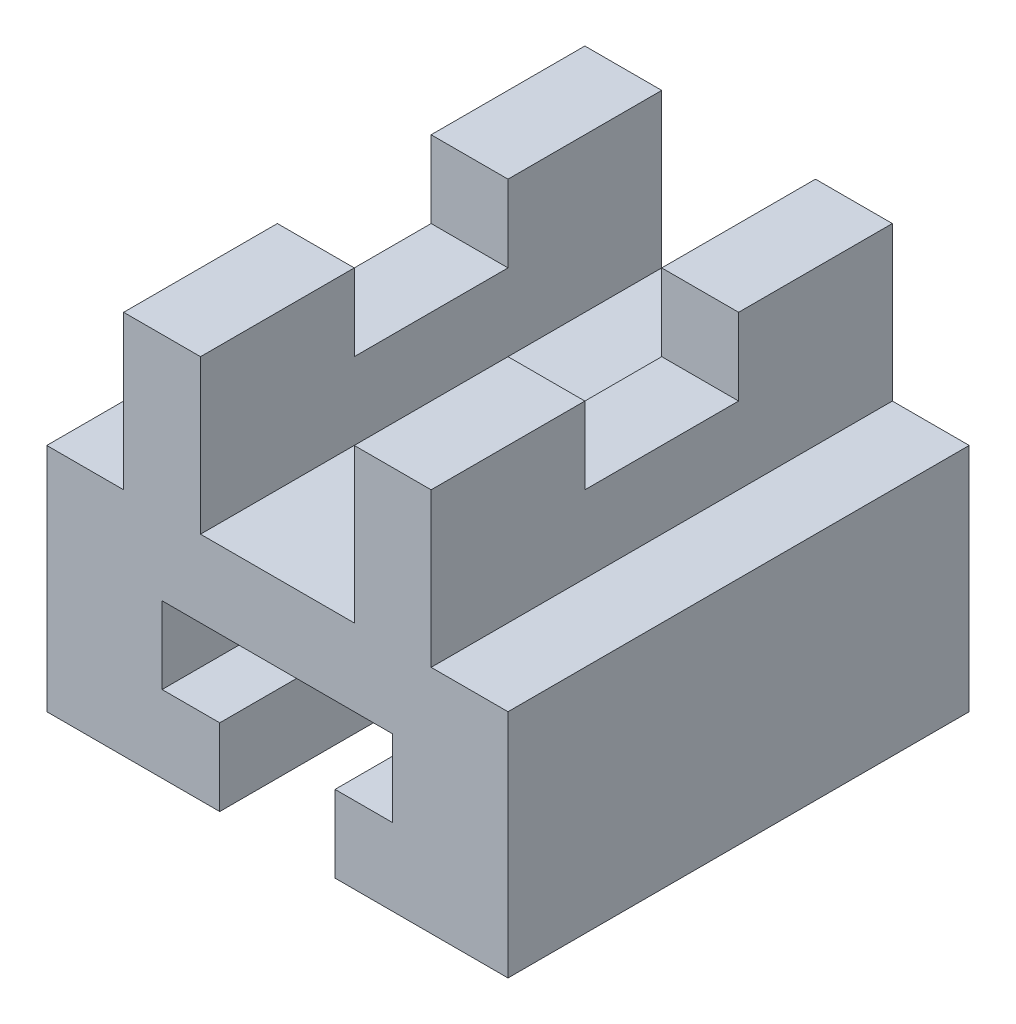
ISO-10303-21;
HEADER;
FILE_DESCRIPTION(('STEP AP214'),'2;1');
FILE_NAME('part.step','',(''),(''),'','','');
FILE_SCHEMA(('AUTOMOTIVE_DESIGN { 1 0 10303 214 1 1 1 1 }'));
ENDSEC;
DATA;
#1=APPLICATION_CONTEXT('core data for automotive mechanical design processes');
#2=APPLICATION_PROTOCOL_DEFINITION('international standard','automotive_design',2000,#1);
#3=PRODUCT_CONTEXT('',#1,'mechanical');
#4=PRODUCT('Part','Part','',(#3));
#5=PRODUCT_RELATED_PRODUCT_CATEGORY('part','',(#4));
#6=PRODUCT_DEFINITION_FORMATION('','',#4);
#7=PRODUCT_DEFINITION_CONTEXT('part definition',#1,'design');
#8=PRODUCT_DEFINITION('design','',#6,#7);
#9=PRODUCT_DEFINITION_SHAPE('','',#8);
#10=(LENGTH_UNIT() NAMED_UNIT(*) SI_UNIT(.MILLI.,.METRE.));
#11=(NAMED_UNIT(*) PLANE_ANGLE_UNIT() SI_UNIT($,.RADIAN.));
#12=(NAMED_UNIT(*) SI_UNIT($,.STERADIAN.) SOLID_ANGLE_UNIT());
#13=UNCERTAINTY_MEASURE_WITH_UNIT(LENGTH_MEASURE(1.E-05),#10,'distance_accuracy_value','');
#14=(GEOMETRIC_REPRESENTATION_CONTEXT(3) GLOBAL_UNCERTAINTY_ASSIGNED_CONTEXT((#13)) GLOBAL_UNIT_ASSIGNED_CONTEXT((#10,
#11,#12)) REPRESENTATION_CONTEXT('',''));
#15=CARTESIAN_POINT('',(0.,0.,0.));
#16=DIRECTION('',(0.,0.,1.));
#17=DIRECTION('',(1.,0.,0.));
#18=AXIS2_PLACEMENT_3D('',#15,#16,#17);
#19=CARTESIAN_POINT('',(14.6539451077223,30.,60.));
#20=DIRECTION('',(0.,-1.,0.));
#21=DIRECTION('',(1.,0.,0.));
#22=AXIS2_PLACEMENT_3D('',#19,#20,#21);
#23=PLANE('',#22);
#24=DIRECTION('',(0.,0.,-1.));
#25=VECTOR('',#24,1.);
#26=CARTESIAN_POINT('',(4.65394510772229,30.,60.));
#27=LINE('',#26,#25);
#28=CARTESIAN_POINT('',(4.6539451077223,30.,20.));
#29=VERTEX_POINT('',#28);
#30=CARTESIAN_POINT('',(4.65394510772229,30.,0.));
#31=VERTEX_POINT('',#30);
#32=EDGE_CURVE('E243',#29,#31,#27,.T.);
#33=ORIENTED_EDGE('',*,*,#32,.F.);
#34=DIRECTION('',(1.,0.,0.));
#35=VECTOR('',#34,1.);
#36=CARTESIAN_POINT('',(-35.3460548922778,30.,20.));
#37=LINE('',#36,#35);
#38=CARTESIAN_POINT('',(14.6539451077223,30.,20.));
#39=VERTEX_POINT('',#38);
#40=EDGE_CURVE('E227',#29,#39,#37,.T.);
#41=ORIENTED_EDGE('',*,*,#40,.T.);
#42=DIRECTION('',(0.,0.,-1.));
#43=VECTOR('',#42,1.);
#44=CARTESIAN_POINT('',(14.6539451077223,30.,60.));
#45=LINE('',#44,#43);
#46=CARTESIAN_POINT('',(14.6539451077223,30.,0.));
#47=VERTEX_POINT('',#46);
#48=EDGE_CURVE('E241',#39,#47,#45,.T.);
#49=ORIENTED_EDGE('',*,*,#48,.T.);
#50=DIRECTION('',(-1.,0.,0.));
#51=VECTOR('',#50,1.);
#52=CARTESIAN_POINT('',(14.6539451077223,30.,0.));
#53=LINE('',#52,#51);
#54=EDGE_CURVE('E435',#47,#31,#53,.T.);
#55=ORIENTED_EDGE('',*,*,#54,.T.);
#56=EDGE_LOOP('',(#33,#41,#49,#55));
#57=FACE_BOUND('',#56,.T.);
#58=ADVANCED_FACE('F39',(#57),#23,.F.);
#59=CARTESIAN_POINT('',(-15.3460548922777,30.,60.));
#60=DIRECTION('',(0.,-1.,0.));
#61=DIRECTION('',(0.,0.,-1.));
#62=AXIS2_PLACEMENT_3D('',#59,#60,#61);
#63=PLANE('',#62);
#64=DIRECTION('',(0.,0.,-1.));
#65=VECTOR('',#64,1.);
#66=CARTESIAN_POINT('',(-25.3460548922777,30.,60.));
#67=LINE('',#66,#65);
#68=CARTESIAN_POINT('',(-25.3460548922777,30.,20.));
#69=VERTEX_POINT('',#68);
#70=CARTESIAN_POINT('',(-25.3460548922777,30.,0.));
#71=VERTEX_POINT('',#70);
#72=EDGE_CURVE('E492',#69,#71,#67,.T.);
#73=ORIENTED_EDGE('',*,*,#72,.F.);
#74=CARTESIAN_POINT('',(-15.3460548922777,30.,20.));
#75=VERTEX_POINT('',#74);
#76=EDGE_CURVE('E245',#69,#75,#37,.T.);
#77=ORIENTED_EDGE('',*,*,#76,.T.);
#78=DIRECTION('',(0.,0.,-1.));
#79=VECTOR('',#78,1.);
#80=CARTESIAN_POINT('',(-15.3460548922777,30.,60.));
#81=LINE('',#80,#79);
#82=CARTESIAN_POINT('',(-15.3460548922777,30.,0.));
#83=VERTEX_POINT('',#82);
#84=EDGE_CURVE('E496',#75,#83,#81,.T.);
#85=ORIENTED_EDGE('',*,*,#84,.T.);
#86=DIRECTION('',(-1.,0.,0.));
#87=VECTOR('',#86,1.);
#88=CARTESIAN_POINT('',(-15.3460548922777,30.,0.));
#89=LINE('',#88,#87);
#90=EDGE_CURVE('E448',#83,#71,#89,.T.);
#91=ORIENTED_EDGE('',*,*,#90,.T.);
#92=EDGE_LOOP('',(#73,#77,#85,#91));
#93=FACE_BOUND('',#92,.T.);
#94=ADVANCED_FACE('F557',(#93),#63,.F.);
#95=CARTESIAN_POINT('',(-20.3460548922777,-10.,60.));
#96=DIRECTION('',(-1.,0.,0.));
#97=DIRECTION('',(0.,0.,1.));
#98=AXIS2_PLACEMENT_3D('',#95,#96,#97);
#99=PLANE('',#98);
#100=DIRECTION('',(0.,1.,0.));
#101=VECTOR('',#100,1.);
#102=CARTESIAN_POINT('',(-20.3460548922777,-10.,0.));
#103=LINE('',#102,#101);
#104=CARTESIAN_POINT('',(-20.3460548922777,-10.,0.));
#105=VERTEX_POINT('',#104);
#106=CARTESIAN_POINT('',(-20.3460548922777,0.,0.));
#107=VERTEX_POINT('',#106);
#108=EDGE_CURVE('E345',#105,#107,#103,.T.);
#109=ORIENTED_EDGE('',*,*,#108,.T.);
#110=DIRECTION('',(0.,0.,-1.));
#111=VECTOR('',#110,1.);
#112=CARTESIAN_POINT('',(-20.3460548922777,0.,60.));
#113=LINE('',#112,#111);
#114=CARTESIAN_POINT('',(-20.3460548922777,0.,60.));
#115=VERTEX_POINT('',#114);
#116=EDGE_CURVE('E291',#115,#107,#113,.T.);
#117=ORIENTED_EDGE('',*,*,#116,.F.);
#118=DIRECTION('',(0.,1.,0.));
#119=VECTOR('',#118,1.);
#120=CARTESIAN_POINT('',(-20.3460548922777,-10.,60.));
#121=LINE('',#120,#119);
#122=CARTESIAN_POINT('',(-20.3460548922777,-10.,60.));
#123=VERTEX_POINT('',#122);
#124=EDGE_CURVE('E346',#123,#115,#121,.T.);
#125=ORIENTED_EDGE('',*,*,#124,.F.);
#126=DIRECTION('',(0.,0.,-1.));
#127=VECTOR('',#126,1.);
#128=CARTESIAN_POINT('',(-20.3460548922777,-10.,60.));
#129=LINE('',#128,#127);
#130=EDGE_CURVE('E408',#123,#105,#129,.T.);
#131=ORIENTED_EDGE('',*,*,#130,.T.);
#132=EDGE_LOOP('',(#109,#117,#125,#131));
#133=FACE_BOUND('',#132,.T.);
#134=ADVANCED_FACE('F41',(#133),#99,.F.);
#135=CARTESIAN_POINT('',(-20.3460548922777,0.,60.));
#136=DIRECTION('',(0.,1.,0.));
#137=DIRECTION('',(0.,0.,1.));
#138=AXIS2_PLACEMENT_3D('',#135,#136,#137);
#139=PLANE('',#138);
#140=DIRECTION('',(1.,0.,0.));
#141=VECTOR('',#140,1.);
#142=CARTESIAN_POINT('',(-20.3460548922777,0.,0.));
#143=LINE('',#142,#141);
#144=CARTESIAN_POINT('',(9.65394510772229,0.,0.));
#145=VERTEX_POINT('',#144);
#146=EDGE_CURVE('E412',#107,#145,#143,.T.);
#147=ORIENTED_EDGE('',*,*,#146,.T.);
#148=DIRECTION('',(0.,0.,-1.));
#149=VECTOR('',#148,1.);
#150=CARTESIAN_POINT('',(9.65394510772229,0.,60.));
#151=LINE('',#150,#149);
#152=CARTESIAN_POINT('',(9.65394510772229,0.,60.));
#153=VERTEX_POINT('',#152);
#154=EDGE_CURVE('E287',#153,#145,#151,.T.);
#155=ORIENTED_EDGE('',*,*,#154,.F.);
#156=DIRECTION('',(1.,0.,0.));
#157=VECTOR('',#156,1.);
#158=CARTESIAN_POINT('',(-20.3460548922777,0.,60.));
#159=LINE('',#158,#157);
#160=EDGE_CURVE('E350',#115,#153,#159,.T.);
#161=ORIENTED_EDGE('',*,*,#160,.F.);
#162=ORIENTED_EDGE('',*,*,#116,.T.);
#163=EDGE_LOOP('',(#147,#155,#161,#162));
#164=FACE_BOUND('',#163,.T.);
#165=ADVANCED_FACE('F597',(#164),#139,.F.);
#166=CARTESIAN_POINT('',(9.65394510772229,0.,60.));
#167=DIRECTION('',(1.,0.,0.));
#168=DIRECTION('',(0.,1.,0.));
#169=AXIS2_PLACEMENT_3D('',#166,#167,#168);
#170=PLANE('',#169);
#171=DIRECTION('',(0.,-1.,0.));
#172=VECTOR('',#171,1.);
#173=CARTESIAN_POINT('',(9.65394510772229,0.,0.));
#174=LINE('',#173,#172);
#175=CARTESIAN_POINT('',(9.65394510772229,-9.99999999999999,0.));
#176=VERTEX_POINT('',#175);
#177=EDGE_CURVE('E415',#145,#176,#174,.T.);
#178=ORIENTED_EDGE('',*,*,#177,.T.);
#179=DIRECTION('',(0.,0.,-1.));
#180=VECTOR('',#179,1.);
#181=CARTESIAN_POINT('',(9.65394510772229,-9.99999999999999,60.));
#182=LINE('',#181,#180);
#183=CARTESIAN_POINT('',(9.65394510772229,-9.99999999999999,60.));
#184=VERTEX_POINT('',#183);
#185=EDGE_CURVE('E283',#184,#176,#182,.T.);
#186=ORIENTED_EDGE('',*,*,#185,.F.);
#187=DIRECTION('',(0.,-1.,0.));
#188=VECTOR('',#187,1.);
#189=CARTESIAN_POINT('',(9.65394510772229,0.,60.));
#190=LINE('',#189,#188);
#191=EDGE_CURVE('E354',#153,#184,#190,.T.);
#192=ORIENTED_EDGE('',*,*,#191,.F.);
#193=ORIENTED_EDGE('',*,*,#154,.T.);
#194=EDGE_LOOP('',(#178,#186,#192,#193));
#195=FACE_BOUND('',#194,.T.);
#196=ADVANCED_FACE('F594',(#195),#170,.F.);
#197=CARTESIAN_POINT('',(9.65394510772229,-9.99999999999999,60.));
#198=DIRECTION('',(0.,-1.,0.));
#199=DIRECTION('',(1.,0.,0.));
#200=AXIS2_PLACEMENT_3D('',#197,#198,#199);
#201=PLANE('',#200);
#202=DIRECTION('',(-1.,0.,0.));
#203=VECTOR('',#202,1.);
#204=CARTESIAN_POINT('',(9.65394510772229,-9.99999999999999,0.));
#205=LINE('',#204,#203);
#206=CARTESIAN_POINT('',(2.15394510772227,-10.,0.));
#207=VERTEX_POINT('',#206);
#208=EDGE_CURVE('E418',#176,#207,#205,.T.);
#209=ORIENTED_EDGE('',*,*,#208,.T.);
#210=DIRECTION('',(0.,0.,-1.));
#211=VECTOR('',#210,1.);
#212=CARTESIAN_POINT('',(2.15394510772227,-10.,60.));
#213=LINE('',#212,#211);
#214=CARTESIAN_POINT('',(2.15394510772227,-10.,60.));
#215=VERTEX_POINT('',#214);
#216=EDGE_CURVE('E279',#215,#207,#213,.T.);
#217=ORIENTED_EDGE('',*,*,#216,.F.);
#218=DIRECTION('',(-1.,0.,0.));
#219=VECTOR('',#218,1.);
#220=CARTESIAN_POINT('',(9.65394510772229,-9.99999999999999,60.));
#221=LINE('',#220,#219);
#222=EDGE_CURVE('E357',#184,#215,#221,.T.);
#223=ORIENTED_EDGE('',*,*,#222,.F.);
#224=ORIENTED_EDGE('',*,*,#185,.T.);
#225=EDGE_LOOP('',(#209,#217,#223,#224));
#226=FACE_BOUND('',#225,.T.);
#227=ADVANCED_FACE('F590',(#226),#201,.F.);
#228=CARTESIAN_POINT('',(2.15394510772227,-10.,60.));
#229=DIRECTION('',(1.,0.,0.));
#230=DIRECTION('',(0.,1.,0.));
#231=AXIS2_PLACEMENT_3D('',#228,#229,#230);
#232=PLANE('',#231);
#233=DIRECTION('',(0.,-1.,0.));
#234=VECTOR('',#233,1.);
#235=CARTESIAN_POINT('',(2.15394510772227,-10.,0.));
#236=LINE('',#235,#234);
#237=CARTESIAN_POINT('',(2.15394510772228,-20.,0.));
#238=VERTEX_POINT('',#237);
#239=EDGE_CURVE('E421',#207,#238,#236,.T.);
#240=ORIENTED_EDGE('',*,*,#239,.T.);
#241=DIRECTION('',(0.,0.,-1.));
#242=VECTOR('',#241,1.);
#243=CARTESIAN_POINT('',(2.15394510772228,-20.,60.));
#244=LINE('',#243,#242);
#245=CARTESIAN_POINT('',(2.15394510772228,-20.,60.));
#246=VERTEX_POINT('',#245);
#247=EDGE_CURVE('E275',#246,#238,#244,.T.);
#248=ORIENTED_EDGE('',*,*,#247,.F.);
#249=DIRECTION('',(0.,-1.,0.));
#250=VECTOR('',#249,1.);
#251=CARTESIAN_POINT('',(2.15394510772227,-10.,60.));
#252=LINE('',#251,#250);
#253=EDGE_CURVE('E360',#215,#246,#252,.T.);
#254=ORIENTED_EDGE('',*,*,#253,.F.);
#255=ORIENTED_EDGE('',*,*,#216,.T.);
#256=EDGE_LOOP('',(#240,#248,#254,#255));
#257=FACE_BOUND('',#256,.T.);
#258=ADVANCED_FACE('F586',(#257),#232,.F.);
#259=CARTESIAN_POINT('',(2.15394510772228,-20.,60.));
#260=DIRECTION('',(0.,1.,0.));
#261=DIRECTION('',(0.,0.,1.));
#262=AXIS2_PLACEMENT_3D('',#259,#260,#261);
#263=PLANE('',#262);
#264=DIRECTION('',(1.,0.,0.));
#265=VECTOR('',#264,1.);
#266=CARTESIAN_POINT('',(2.15394510772228,-20.,0.));
#267=LINE('',#266,#265);
#268=CARTESIAN_POINT('',(24.6539451077223,-20.,0.));
#269=VERTEX_POINT('',#268);
#270=EDGE_CURVE('E424',#238,#269,#267,.T.);
#271=ORIENTED_EDGE('',*,*,#270,.T.);
#272=DIRECTION('',(0.,0.,-1.));
#273=VECTOR('',#272,1.);
#274=CARTESIAN_POINT('',(24.6539451077223,-20.,60.));
#275=LINE('',#274,#273);
#276=CARTESIAN_POINT('',(24.6539451077223,-20.,60.));
#277=VERTEX_POINT('',#276);
#278=EDGE_CURVE('E271',#277,#269,#275,.T.);
#279=ORIENTED_EDGE('',*,*,#278,.F.);
#280=DIRECTION('',(1.,0.,0.));
#281=VECTOR('',#280,1.);
#282=CARTESIAN_POINT('',(2.15394510772228,-20.,60.));
#283=LINE('',#282,#281);
#284=EDGE_CURVE('E363',#246,#277,#283,.T.);
#285=ORIENTED_EDGE('',*,*,#284,.F.);
#286=ORIENTED_EDGE('',*,*,#247,.T.);
#287=EDGE_LOOP('',(#271,#279,#285,#286));
#288=FACE_BOUND('',#287,.T.);
#289=ADVANCED_FACE('F582',(#288),#263,.F.);
#290=CARTESIAN_POINT('',(24.6539451077223,-20.,60.));
#291=DIRECTION('',(-1.,0.,0.));
#292=DIRECTION('',(0.,-1.,0.));
#293=AXIS2_PLACEMENT_3D('',#290,#291,#292);
#294=PLANE('',#293);
#295=DIRECTION('',(0.,1.,0.));
#296=VECTOR('',#295,1.);
#297=CARTESIAN_POINT('',(24.6539451077223,-20.,0.));
#298=LINE('',#297,#296);
#299=CARTESIAN_POINT('',(24.6539451077223,10.,0.));
#300=VERTEX_POINT('',#299);
#301=EDGE_CURVE('E427',#269,#300,#298,.T.);
#302=ORIENTED_EDGE('',*,*,#301,.T.);
#303=DIRECTION('',(0.,0.,-1.));
#304=VECTOR('',#303,1.);
#305=CARTESIAN_POINT('',(24.6539451077223,10.,60.));
#306=LINE('',#305,#304);
#307=CARTESIAN_POINT('',(24.6539451077223,10.,60.));
#308=VERTEX_POINT('',#307);
#309=EDGE_CURVE('E267',#308,#300,#306,.T.);
#310=ORIENTED_EDGE('',*,*,#309,.F.);
#311=DIRECTION('',(0.,1.,0.));
#312=VECTOR('',#311,1.);
#313=CARTESIAN_POINT('',(24.6539451077223,-20.,60.));
#314=LINE('',#313,#312);
#315=EDGE_CURVE('E366',#277,#308,#314,.T.);
#316=ORIENTED_EDGE('',*,*,#315,.F.);
#317=ORIENTED_EDGE('',*,*,#278,.T.);
#318=EDGE_LOOP('',(#302,#310,#316,#317));
#319=FACE_BOUND('',#318,.T.);
#320=ADVANCED_FACE('F576',(#319),#294,.F.);
#321=CARTESIAN_POINT('',(24.6539451077223,10.,60.));
#322=DIRECTION('',(0.,-1.,0.));
#323=DIRECTION('',(0.,0.,-1.));
#324=AXIS2_PLACEMENT_3D('',#321,#322,#323);
#325=PLANE('',#324);
#326=DIRECTION('',(-1.,0.,0.));
#327=VECTOR('',#326,1.);
#328=CARTESIAN_POINT('',(24.6539451077223,10.,0.));
#329=LINE('',#328,#327);
#330=CARTESIAN_POINT('',(14.6539451077223,10.,0.));
#331=VERTEX_POINT('',#330);
#332=EDGE_CURVE('E430',#300,#331,#329,.T.);
#333=ORIENTED_EDGE('',*,*,#332,.T.);
#334=DIRECTION('',(0.,0.,-1.));
#335=VECTOR('',#334,1.);
#336=CARTESIAN_POINT('',(14.6539451077223,10.,60.));
#337=LINE('',#336,#335);
#338=CARTESIAN_POINT('',(14.6539451077223,10.,60.));
#339=VERTEX_POINT('',#338);
#340=EDGE_CURVE('E260',#339,#331,#337,.T.);
#341=ORIENTED_EDGE('',*,*,#340,.F.);
#342=DIRECTION('',(-1.,0.,0.));
#343=VECTOR('',#342,1.);
#344=CARTESIAN_POINT('',(24.6539451077223,10.,60.));
#345=LINE('',#344,#343);
#346=EDGE_CURVE('E369',#308,#339,#345,.T.);
#347=ORIENTED_EDGE('',*,*,#346,.F.);
#348=ORIENTED_EDGE('',*,*,#309,.T.);
#349=EDGE_LOOP('',(#333,#341,#347,#348));
#350=FACE_BOUND('',#349,.T.);
#351=ADVANCED_FACE('F572',(#350),#325,.F.);
#352=CARTESIAN_POINT('',(14.6539451077223,10.,60.));
#353=DIRECTION('',(-1.,0.,0.));
#354=DIRECTION('',(0.,0.,1.));
#355=AXIS2_PLACEMENT_3D('',#352,#353,#354);
#356=PLANE('',#355);
#357=ORIENTED_EDGE('',*,*,#48,.F.);
#358=DIRECTION('',(0.,1.,0.));
#359=VECTOR('',#358,1.);
#360=CARTESIAN_POINT('',(14.6539451077223,20.,20.));
#361=LINE('',#360,#359);
#362=CARTESIAN_POINT('',(14.6539451077223,20.,20.));
#363=VERTEX_POINT('',#362);
#364=EDGE_CURVE('E224',#363,#39,#361,.T.);
#365=ORIENTED_EDGE('',*,*,#364,.F.);
#366=DIRECTION('',(0.,0.,-1.));
#367=VECTOR('',#366,1.);
#368=CARTESIAN_POINT('',(14.6539451077223,20.,40.));
#369=LINE('',#368,#367);
#370=CARTESIAN_POINT('',(14.6539451077223,20.,40.));
#371=VERTEX_POINT('',#370);
#372=EDGE_CURVE('E246',#371,#363,#369,.T.);
#373=ORIENTED_EDGE('',*,*,#372,.F.);
#374=DIRECTION('',(0.,-1.,0.));
#375=VECTOR('',#374,1.);
#376=CARTESIAN_POINT('',(14.6539451077223,30.,40.));
#377=LINE('',#376,#375);
#378=CARTESIAN_POINT('',(14.6539451077223,30.,40.));
#379=VERTEX_POINT('',#378);
#380=EDGE_CURVE('E236',#379,#371,#377,.T.);
#381=ORIENTED_EDGE('',*,*,#380,.F.);
#382=CARTESIAN_POINT('',(14.6539451077223,30.,60.));
#383=VERTEX_POINT('',#382);
#384=EDGE_CURVE('E254',#383,#379,#45,.T.);
#385=ORIENTED_EDGE('',*,*,#384,.F.);
#386=DIRECTION('',(0.,1.,0.));
#387=VECTOR('',#386,1.);
#388=CARTESIAN_POINT('',(14.6539451077223,10.,60.));
#389=LINE('',#388,#387);
#390=EDGE_CURVE('E372',#339,#383,#389,.T.);
#391=ORIENTED_EDGE('',*,*,#390,.F.);
#392=ORIENTED_EDGE('',*,*,#340,.T.);
#393=DIRECTION('',(0.,1.,0.));
#394=VECTOR('',#393,1.);
#395=CARTESIAN_POINT('',(14.6539451077223,10.,0.));
#396=LINE('',#395,#394);
#397=EDGE_CURVE('E251',#331,#47,#396,.T.);
#398=ORIENTED_EDGE('',*,*,#397,.T.);
#399=EDGE_LOOP('',(#357,#365,#373,#381,#385,#391,#392,#398));
#400=FACE_BOUND('',#399,.T.);
#401=ADVANCED_FACE('F248',(#400),#356,.F.);
#402=ORIENTED_EDGE('',*,*,#384,.T.);
#403=DIRECTION('',(1.,0.,0.));
#404=VECTOR('',#403,1.);
#405=CARTESIAN_POINT('',(-35.3460548922778,30.,40.));
#406=LINE('',#405,#404);
#407=CARTESIAN_POINT('',(4.6539451077223,30.,40.));
#408=VERTEX_POINT('',#407);
#409=EDGE_CURVE('E327',#408,#379,#406,.T.);
#410=ORIENTED_EDGE('',*,*,#409,.F.);
#411=CARTESIAN_POINT('',(4.65394510772229,30.,60.));
#412=VERTEX_POINT('',#411);
#413=EDGE_CURVE('E255',#412,#408,#27,.T.);
#414=ORIENTED_EDGE('',*,*,#413,.F.);
#415=DIRECTION('',(-1.,0.,0.));
#416=VECTOR('',#415,1.);
#417=CARTESIAN_POINT('',(14.6539451077223,30.,60.));
#418=LINE('',#417,#416);
#419=EDGE_CURVE('E375',#383,#412,#418,.T.);
#420=ORIENTED_EDGE('',*,*,#419,.F.);
#421=EDGE_LOOP('',(#402,#410,#414,#420));
#422=FACE_BOUND('',#421,.T.);
#423=ADVANCED_FACE('F536',(#422),#23,.F.);
#424=CARTESIAN_POINT('',(4.65394510772229,30.,60.));
#425=DIRECTION('',(1.,0.,0.));
#426=DIRECTION('',(0.,1.,0.));
#427=AXIS2_PLACEMENT_3D('',#424,#425,#426);
#428=PLANE('',#427);
#429=DIRECTION('',(0.,0.,-1.));
#430=VECTOR('',#429,1.);
#431=CARTESIAN_POINT('',(4.65394510772229,20.,60.));
#432=LINE('',#431,#430);
#433=CARTESIAN_POINT('',(4.65394510772229,20.,40.));
#434=VERTEX_POINT('',#433);
#435=CARTESIAN_POINT('',(4.6539451077223,20.,20.));
#436=VERTEX_POINT('',#435);
#437=EDGE_CURVE('E335',#434,#436,#432,.T.);
#438=ORIENTED_EDGE('',*,*,#437,.T.);
#439=DIRECTION('',(0.,1.,0.));
#440=VECTOR('',#439,1.);
#441=CARTESIAN_POINT('',(4.65394510772229,30.,20.));
#442=LINE('',#441,#440);
#443=EDGE_CURVE('E342',#436,#29,#442,.T.);
#444=ORIENTED_EDGE('',*,*,#443,.T.);
#445=ORIENTED_EDGE('',*,*,#32,.T.);
#446=DIRECTION('',(0.,-1.,0.));
#447=VECTOR('',#446,1.);
#448=CARTESIAN_POINT('',(4.65394510772229,30.,0.));
#449=LINE('',#448,#447);
#450=CARTESIAN_POINT('',(4.65394510772229,10.,0.));
#451=VERTEX_POINT('',#450);
#452=EDGE_CURVE('E438',#31,#451,#449,.T.);
#453=ORIENTED_EDGE('',*,*,#452,.T.);
#454=DIRECTION('',(0.,0.,-1.));
#455=VECTOR('',#454,1.);
#456=CARTESIAN_POINT('',(4.65394510772229,10.,60.));
#457=LINE('',#456,#455);
#458=CARTESIAN_POINT('',(4.65394510772229,10.,60.));
#459=VERTEX_POINT('',#458);
#460=EDGE_CURVE('E504',#459,#451,#457,.T.);
#461=ORIENTED_EDGE('',*,*,#460,.F.);
#462=DIRECTION('',(0.,-1.,0.));
#463=VECTOR('',#462,1.);
#464=CARTESIAN_POINT('',(4.65394510772229,30.,60.));
#465=LINE('',#464,#463);
#466=EDGE_CURVE('E378',#412,#459,#465,.T.);
#467=ORIENTED_EDGE('',*,*,#466,.F.);
#468=ORIENTED_EDGE('',*,*,#413,.T.);
#469=DIRECTION('',(0.,-1.,0.));
#470=VECTOR('',#469,1.);
#471=CARTESIAN_POINT('',(4.65394510772229,30.,40.));
#472=LINE('',#471,#470);
#473=EDGE_CURVE('E319',#408,#434,#472,.T.);
#474=ORIENTED_EDGE('',*,*,#473,.T.);
#475=EDGE_LOOP('',(#438,#444,#445,#453,#461,#467,#468,#474));
#476=FACE_BOUND('',#475,.T.);
#477=ADVANCED_FACE('F513',(#476),#428,.F.);
#478=CARTESIAN_POINT('',(4.65394510772229,10.,60.));
#479=DIRECTION('',(0.,-1.,0.));
#480=DIRECTION('',(1.,0.,0.));
#481=AXIS2_PLACEMENT_3D('',#478,#479,#480);
#482=PLANE('',#481);
#483=DIRECTION('',(-1.,0.,0.));
#484=VECTOR('',#483,1.);
#485=CARTESIAN_POINT('',(4.65394510772229,10.,0.));
#486=LINE('',#485,#484);
#487=CARTESIAN_POINT('',(-15.3460548922777,10.,0.));
#488=VERTEX_POINT('',#487);
#489=EDGE_CURVE('E441',#451,#488,#486,.T.);
#490=ORIENTED_EDGE('',*,*,#489,.T.);
#491=DIRECTION('',(0.,0.,-1.));
#492=VECTOR('',#491,1.);
#493=CARTESIAN_POINT('',(-15.3460548922777,10.,60.));
#494=LINE('',#493,#492);
#495=CARTESIAN_POINT('',(-15.3460548922777,10.,60.));
#496=VERTEX_POINT('',#495);
#497=EDGE_CURVE('E501',#496,#488,#494,.T.);
#498=ORIENTED_EDGE('',*,*,#497,.F.);
#499=DIRECTION('',(-1.,0.,0.));
#500=VECTOR('',#499,1.);
#501=CARTESIAN_POINT('',(4.65394510772229,10.,60.));
#502=LINE('',#501,#500);
#503=EDGE_CURVE('E381',#459,#496,#502,.T.);
#504=ORIENTED_EDGE('',*,*,#503,.F.);
#505=ORIENTED_EDGE('',*,*,#460,.T.);
#506=EDGE_LOOP('',(#490,#498,#504,#505));
#507=FACE_BOUND('',#506,.T.);
#508=ADVANCED_FACE('F521',(#507),#482,.F.);
#509=CARTESIAN_POINT('',(-15.3460548922777,10.,60.));
#510=DIRECTION('',(-1.,0.,0.));
#511=DIRECTION('',(0.,0.,1.));
#512=AXIS2_PLACEMENT_3D('',#509,#510,#511);
#513=PLANE('',#512);
#514=ORIENTED_EDGE('',*,*,#84,.F.);
#515=DIRECTION('',(0.,-1.,0.));
#516=VECTOR('',#515,1.);
#517=CARTESIAN_POINT('',(-15.3460548922777,10.,20.));
#518=LINE('',#517,#516);
#519=CARTESIAN_POINT('',(-15.3460548922777,20.,20.));
#520=VERTEX_POINT('',#519);
#521=EDGE_CURVE('E339',#75,#520,#518,.T.);
#522=ORIENTED_EDGE('',*,*,#521,.T.);
#523=DIRECTION('',(0.,0.,1.));
#524=VECTOR('',#523,1.);
#525=CARTESIAN_POINT('',(-15.3460548922777,20.,60.));
#526=LINE('',#525,#524);
#527=CARTESIAN_POINT('',(-15.3460548922777,20.,40.));
#528=VERTEX_POINT('',#527);
#529=EDGE_CURVE('E310',#520,#528,#526,.T.);
#530=ORIENTED_EDGE('',*,*,#529,.T.);
#531=DIRECTION('',(0.,1.,0.));
#532=VECTOR('',#531,1.);
#533=CARTESIAN_POINT('',(-15.3460548922777,10.,40.));
#534=LINE('',#533,#532);
#535=CARTESIAN_POINT('',(-15.3460548922777,30.,40.));
#536=VERTEX_POINT('',#535);
#537=EDGE_CURVE('E314',#528,#536,#534,.T.);
#538=ORIENTED_EDGE('',*,*,#537,.T.);
#539=CARTESIAN_POINT('',(-15.3460548922777,30.,60.));
#540=VERTEX_POINT('',#539);
#541=EDGE_CURVE('E497',#540,#536,#81,.T.);
#542=ORIENTED_EDGE('',*,*,#541,.F.);
#543=DIRECTION('',(0.,1.,0.));
#544=VECTOR('',#543,1.);
#545=CARTESIAN_POINT('',(-15.3460548922777,10.,60.));
#546=LINE('',#545,#544);
#547=EDGE_CURVE('E384',#496,#540,#546,.T.);
#548=ORIENTED_EDGE('',*,*,#547,.F.);
#549=ORIENTED_EDGE('',*,*,#497,.T.);
#550=DIRECTION('',(0.,1.,0.));
#551=VECTOR('',#550,1.);
#552=CARTESIAN_POINT('',(-15.3460548922777,10.,0.));
#553=LINE('',#552,#551);
#554=EDGE_CURVE('E444',#488,#83,#553,.T.);
#555=ORIENTED_EDGE('',*,*,#554,.T.);
#556=EDGE_LOOP('',(#514,#522,#530,#538,#542,#548,#549,#555));
#557=FACE_BOUND('',#556,.T.);
#558=ADVANCED_FACE('F525',(#557),#513,.F.);
#559=ORIENTED_EDGE('',*,*,#541,.T.);
#560=CARTESIAN_POINT('',(-25.3460548922777,30.,40.));
#561=VERTEX_POINT('',#560);
#562=EDGE_CURVE('E326',#561,#536,#406,.T.);
#563=ORIENTED_EDGE('',*,*,#562,.F.);
#564=CARTESIAN_POINT('',(-25.3460548922777,30.,60.));
#565=VERTEX_POINT('',#564);
#566=EDGE_CURVE('E493',#565,#561,#67,.T.);
#567=ORIENTED_EDGE('',*,*,#566,.F.);
#568=DIRECTION('',(-1.,0.,0.));
#569=VECTOR('',#568,1.);
#570=CARTESIAN_POINT('',(-15.3460548922777,30.,60.));
#571=LINE('',#570,#569);
#572=EDGE_CURVE('E387',#540,#565,#571,.T.);
#573=ORIENTED_EDGE('',*,*,#572,.F.);
#574=EDGE_LOOP('',(#559,#563,#567,#573));
#575=FACE_BOUND('',#574,.T.);
#576=ADVANCED_FACE('F564',(#575),#63,.F.);
#577=CARTESIAN_POINT('',(-25.3460548922777,30.,60.));
#578=DIRECTION('',(1.,0.,0.));
#579=DIRECTION('',(0.,0.,-1.));
#580=AXIS2_PLACEMENT_3D('',#577,#578,#579);
#581=PLANE('',#580);
#582=DIRECTION('',(0.,0.,-1.));
#583=VECTOR('',#582,1.);
#584=CARTESIAN_POINT('',(-25.3460548922777,20.,60.));
#585=LINE('',#584,#583);
#586=CARTESIAN_POINT('',(-25.3460548922777,20.,40.));
#587=VERTEX_POINT('',#586);
#588=CARTESIAN_POINT('',(-25.3460548922777,20.,20.));
#589=VERTEX_POINT('',#588);
#590=EDGE_CURVE('E48',#587,#589,#585,.T.);
#591=ORIENTED_EDGE('',*,*,#590,.T.);
#592=DIRECTION('',(0.,1.,0.));
#593=VECTOR('',#592,1.);
#594=CARTESIAN_POINT('',(-25.3460548922777,30.,20.));
#595=LINE('',#594,#593);
#596=EDGE_CURVE('E11',#589,#69,#595,.T.);
#597=ORIENTED_EDGE('',*,*,#596,.T.);
#598=ORIENTED_EDGE('',*,*,#72,.T.);
#599=DIRECTION('',(0.,-1.,0.));
#600=VECTOR('',#599,1.);
#601=CARTESIAN_POINT('',(-25.3460548922777,30.,0.));
#602=LINE('',#601,#600);
#603=CARTESIAN_POINT('',(-25.3460548922777,10.,0.));
#604=VERTEX_POINT('',#603);
#605=EDGE_CURVE('E452',#71,#604,#602,.T.);
#606=ORIENTED_EDGE('',*,*,#605,.T.);
#607=DIRECTION('',(0.,0.,-1.));
#608=VECTOR('',#607,1.);
#609=CARTESIAN_POINT('',(-25.3460548922777,10.,60.));
#610=LINE('',#609,#608);
#611=CARTESIAN_POINT('',(-25.3460548922777,10.,60.));
#612=VERTEX_POINT('',#611);
#613=EDGE_CURVE('E488',#612,#604,#610,.T.);
#614=ORIENTED_EDGE('',*,*,#613,.F.);
#615=DIRECTION('',(0.,-1.,0.));
#616=VECTOR('',#615,1.);
#617=CARTESIAN_POINT('',(-25.3460548922777,30.,60.));
#618=LINE('',#617,#616);
#619=EDGE_CURVE('E390',#565,#612,#618,.T.);
#620=ORIENTED_EDGE('',*,*,#619,.F.);
#621=ORIENTED_EDGE('',*,*,#566,.T.);
#622=DIRECTION('',(0.,-1.,0.));
#623=VECTOR('',#622,1.);
#624=CARTESIAN_POINT('',(-25.3460548922777,30.,40.));
#625=LINE('',#624,#623);
#626=EDGE_CURVE('E295',#561,#587,#625,.T.);
#627=ORIENTED_EDGE('',*,*,#626,.T.);
#628=EDGE_LOOP('',(#591,#597,#598,#606,#614,#620,#621,#627));
#629=FACE_BOUND('',#628,.T.);
#630=ADVANCED_FACE('F301',(#629),#581,.F.);
#631=CARTESIAN_POINT('',(-25.3460548922777,10.,60.));
#632=DIRECTION('',(0.,-1.,0.));
#633=DIRECTION('',(0.,0.,-1.));
#634=AXIS2_PLACEMENT_3D('',#631,#632,#633);
#635=PLANE('',#634);
#636=DIRECTION('',(-1.,0.,0.));
#637=VECTOR('',#636,1.);
#638=CARTESIAN_POINT('',(-25.3460548922777,10.,0.));
#639=LINE('',#638,#637);
#640=CARTESIAN_POINT('',(-35.3460548922778,10.,0.));
#641=VERTEX_POINT('',#640);
#642=EDGE_CURVE('E455',#604,#641,#639,.T.);
#643=ORIENTED_EDGE('',*,*,#642,.T.);
#644=DIRECTION('',(0.,0.,-1.));
#645=VECTOR('',#644,1.);
#646=CARTESIAN_POINT('',(-35.3460548922778,10.,60.));
#647=LINE('',#646,#645);
#648=CARTESIAN_POINT('',(-35.3460548922778,10.,60.));
#649=VERTEX_POINT('',#648);
#650=EDGE_CURVE('E484',#649,#641,#647,.T.);
#651=ORIENTED_EDGE('',*,*,#650,.F.);
#652=DIRECTION('',(-1.,0.,0.));
#653=VECTOR('',#652,1.);
#654=CARTESIAN_POINT('',(-25.3460548922777,10.,60.));
#655=LINE('',#654,#653);
#656=EDGE_CURVE('E393',#612,#649,#655,.T.);
#657=ORIENTED_EDGE('',*,*,#656,.F.);
#658=ORIENTED_EDGE('',*,*,#613,.T.);
#659=EDGE_LOOP('',(#643,#651,#657,#658));
#660=FACE_BOUND('',#659,.T.);
#661=ADVANCED_FACE('F645',(#660),#635,.F.);
#662=CARTESIAN_POINT('',(-35.3460548922778,10.,60.));
#663=DIRECTION('',(1.,0.,0.));
#664=DIRECTION('',(0.,0.,-1.));
#665=AXIS2_PLACEMENT_3D('',#662,#663,#664);
#666=PLANE('',#665);
#667=DIRECTION('',(0.,-1.,0.));
#668=VECTOR('',#667,1.);
#669=CARTESIAN_POINT('',(-35.3460548922778,10.,0.));
#670=LINE('',#669,#668);
#671=CARTESIAN_POINT('',(-35.3460548922778,-20.,0.));
#672=VERTEX_POINT('',#671);
#673=EDGE_CURVE('E458',#641,#672,#670,.T.);
#674=ORIENTED_EDGE('',*,*,#673,.T.);
#675=DIRECTION('',(0.,0.,-1.));
#676=VECTOR('',#675,1.);
#677=CARTESIAN_POINT('',(-35.3460548922778,-20.,60.));
#678=LINE('',#677,#676);
#679=CARTESIAN_POINT('',(-35.3460548922778,-20.,60.));
#680=VERTEX_POINT('',#679);
#681=EDGE_CURVE('E480',#680,#672,#678,.T.);
#682=ORIENTED_EDGE('',*,*,#681,.F.);
#683=DIRECTION('',(0.,-1.,0.));
#684=VECTOR('',#683,1.);
#685=CARTESIAN_POINT('',(-35.3460548922778,10.,60.));
#686=LINE('',#685,#684);
#687=EDGE_CURVE('E396',#649,#680,#686,.T.);
#688=ORIENTED_EDGE('',*,*,#687,.F.);
#689=ORIENTED_EDGE('',*,*,#650,.T.);
#690=EDGE_LOOP('',(#674,#682,#688,#689));
#691=FACE_BOUND('',#690,.T.);
#692=ADVANCED_FACE('F640',(#691),#666,.F.);
#693=CARTESIAN_POINT('',(-35.3460548922778,-20.,60.));
#694=DIRECTION('',(0.,1.,0.));
#695=DIRECTION('',(0.,0.,1.));
#696=AXIS2_PLACEMENT_3D('',#693,#694,#695);
#697=PLANE('',#696);
#698=DIRECTION('',(1.,0.,0.));
#699=VECTOR('',#698,1.);
#700=CARTESIAN_POINT('',(-35.3460548922778,-20.,0.));
#701=LINE('',#700,#699);
#702=CARTESIAN_POINT('',(-12.8460548922777,-20.,0.));
#703=VERTEX_POINT('',#702);
#704=EDGE_CURVE('E461',#672,#703,#701,.T.);
#705=ORIENTED_EDGE('',*,*,#704,.T.);
#706=DIRECTION('',(0.,0.,-1.));
#707=VECTOR('',#706,1.);
#708=CARTESIAN_POINT('',(-12.8460548922777,-20.,60.));
#709=LINE('',#708,#707);
#710=CARTESIAN_POINT('',(-12.8460548922777,-20.,60.));
#711=VERTEX_POINT('',#710);
#712=EDGE_CURVE('E476',#711,#703,#709,.T.);
#713=ORIENTED_EDGE('',*,*,#712,.F.);
#714=DIRECTION('',(1.,0.,0.));
#715=VECTOR('',#714,1.);
#716=CARTESIAN_POINT('',(-35.3460548922778,-20.,60.));
#717=LINE('',#716,#715);
#718=EDGE_CURVE('E399',#680,#711,#717,.T.);
#719=ORIENTED_EDGE('',*,*,#718,.F.);
#720=ORIENTED_EDGE('',*,*,#681,.T.);
#721=EDGE_LOOP('',(#705,#713,#719,#720));
#722=FACE_BOUND('',#721,.T.);
#723=ADVANCED_FACE('F634',(#722),#697,.F.);
#724=CARTESIAN_POINT('',(-12.8460548922777,-20.,60.));
#725=DIRECTION('',(-1.,0.,0.));
#726=DIRECTION('',(0.,-1.,0.));
#727=AXIS2_PLACEMENT_3D('',#724,#725,#726);
#728=PLANE('',#727);
#729=DIRECTION('',(0.,1.,0.));
#730=VECTOR('',#729,1.);
#731=CARTESIAN_POINT('',(-12.8460548922777,-20.,0.));
#732=LINE('',#731,#730);
#733=CARTESIAN_POINT('',(-12.8460548922777,-10.,0.));
#734=VERTEX_POINT('',#733);
#735=EDGE_CURVE('E464',#703,#734,#732,.T.);
#736=ORIENTED_EDGE('',*,*,#735,.T.);
#737=DIRECTION('',(0.,0.,-1.));
#738=VECTOR('',#737,1.);
#739=CARTESIAN_POINT('',(-12.8460548922777,-10.,60.));
#740=LINE('',#739,#738);
#741=CARTESIAN_POINT('',(-12.8460548922777,-10.,60.));
#742=VERTEX_POINT('',#741);
#743=EDGE_CURVE('E472',#742,#734,#740,.T.);
#744=ORIENTED_EDGE('',*,*,#743,.F.);
#745=DIRECTION('',(0.,1.,0.));
#746=VECTOR('',#745,1.);
#747=CARTESIAN_POINT('',(-12.8460548922777,-20.,60.));
#748=LINE('',#747,#746);
#749=EDGE_CURVE('E402',#711,#742,#748,.T.);
#750=ORIENTED_EDGE('',*,*,#749,.F.);
#751=ORIENTED_EDGE('',*,*,#712,.T.);
#752=EDGE_LOOP('',(#736,#744,#750,#751));
#753=FACE_BOUND('',#752,.T.);
#754=ADVANCED_FACE('F630',(#753),#728,.F.);
#755=CARTESIAN_POINT('',(-12.8460548922777,-10.,60.));
#756=DIRECTION('',(0.,-1.,0.));
#757=DIRECTION('',(1.,0.,0.));
#758=AXIS2_PLACEMENT_3D('',#755,#756,#757);
#759=PLANE('',#758);
#760=DIRECTION('',(-1.,0.,0.));
#761=VECTOR('',#760,1.);
#762=CARTESIAN_POINT('',(-12.8460548922777,-10.,0.));
#763=LINE('',#762,#761);
#764=EDGE_CURVE('E351',#734,#105,#763,.T.);
#765=ORIENTED_EDGE('',*,*,#764,.T.);
#766=ORIENTED_EDGE('',*,*,#130,.F.);
#767=DIRECTION('',(-1.,0.,0.));
#768=VECTOR('',#767,1.);
#769=CARTESIAN_POINT('',(-12.8460548922777,-10.,60.));
#770=LINE('',#769,#768);
#771=EDGE_CURVE('E405',#742,#123,#770,.T.);
#772=ORIENTED_EDGE('',*,*,#771,.F.);
#773=ORIENTED_EDGE('',*,*,#743,.T.);
#774=EDGE_LOOP('',(#765,#766,#772,#773));
#775=FACE_BOUND('',#774,.T.);
#776=ADVANCED_FACE('F626',(#775),#759,.F.);
#777=CARTESIAN_POINT('',(0.,0.,60.));
#778=DIRECTION('',(0.,0.,-1.));
#779=DIRECTION('',(-1.,0.,0.));
#780=AXIS2_PLACEMENT_3D('',#777,#778,#779);
#781=PLANE('',#780);
#782=ORIENTED_EDGE('',*,*,#124,.T.);
#783=ORIENTED_EDGE('',*,*,#160,.T.);
#784=ORIENTED_EDGE('',*,*,#191,.T.);
#785=ORIENTED_EDGE('',*,*,#222,.T.);
#786=ORIENTED_EDGE('',*,*,#253,.T.);
#787=ORIENTED_EDGE('',*,*,#284,.T.);
#788=ORIENTED_EDGE('',*,*,#315,.T.);
#789=ORIENTED_EDGE('',*,*,#346,.T.);
#790=ORIENTED_EDGE('',*,*,#390,.T.);
#791=ORIENTED_EDGE('',*,*,#419,.T.);
#792=ORIENTED_EDGE('',*,*,#466,.T.);
#793=ORIENTED_EDGE('',*,*,#503,.T.);
#794=ORIENTED_EDGE('',*,*,#547,.T.);
#795=ORIENTED_EDGE('',*,*,#572,.T.);
#796=ORIENTED_EDGE('',*,*,#619,.T.);
#797=ORIENTED_EDGE('',*,*,#656,.T.);
#798=ORIENTED_EDGE('',*,*,#687,.T.);
#799=ORIENTED_EDGE('',*,*,#718,.T.);
#800=ORIENTED_EDGE('',*,*,#749,.T.);
#801=ORIENTED_EDGE('',*,*,#771,.T.);
#802=EDGE_LOOP('',(#782,#783,#784,#785,#786,#787,#788,#789,#790,#791,#792,#793,#794,#795,#796,
#797,#798,#799,#800,#801));
#803=FACE_BOUND('',#802,.T.);
#804=ADVANCED_FACE('F529',(#803),#781,.F.);
#805=CARTESIAN_POINT('',(0.,0.,0.));
#806=DIRECTION('',(0.,0.,-1.));
#807=DIRECTION('',(-1.,0.,0.));
#808=AXIS2_PLACEMENT_3D('',#805,#806,#807);
#809=PLANE('',#808);
#810=ORIENTED_EDGE('',*,*,#108,.F.);
#811=ORIENTED_EDGE('',*,*,#764,.F.);
#812=ORIENTED_EDGE('',*,*,#735,.F.);
#813=ORIENTED_EDGE('',*,*,#704,.F.);
#814=ORIENTED_EDGE('',*,*,#673,.F.);
#815=ORIENTED_EDGE('',*,*,#642,.F.);
#816=ORIENTED_EDGE('',*,*,#605,.F.);
#817=ORIENTED_EDGE('',*,*,#90,.F.);
#818=ORIENTED_EDGE('',*,*,#554,.F.);
#819=ORIENTED_EDGE('',*,*,#489,.F.);
#820=ORIENTED_EDGE('',*,*,#452,.F.);
#821=ORIENTED_EDGE('',*,*,#54,.F.);
#822=ORIENTED_EDGE('',*,*,#397,.F.);
#823=ORIENTED_EDGE('',*,*,#332,.F.);
#824=ORIENTED_EDGE('',*,*,#301,.F.);
#825=ORIENTED_EDGE('',*,*,#270,.F.);
#826=ORIENTED_EDGE('',*,*,#239,.F.);
#827=ORIENTED_EDGE('',*,*,#208,.F.);
#828=ORIENTED_EDGE('',*,*,#177,.F.);
#829=ORIENTED_EDGE('',*,*,#146,.F.);
#830=EDGE_LOOP('',(#810,#811,#812,#813,#814,#815,#816,#817,#818,#819,#820,#821,#822,#823,#824,
#825,#826,#827,#828,#829));
#831=FACE_BOUND('',#830,.T.);
#832=ADVANCED_FACE('F517',(#831),#809,.T.);
#833=CARTESIAN_POINT('',(-35.3460548922778,30.,40.));
#834=DIRECTION('',(0.,0.,1.));
#835=DIRECTION('',(1.,0.,0.));
#836=AXIS2_PLACEMENT_3D('',#833,#834,#835);
#837=PLANE('',#836);
#838=DIRECTION('',(1.,0.,0.));
#839=VECTOR('',#838,1.);
#840=CARTESIAN_POINT('',(-35.3460548922778,20.,40.));
#841=LINE('',#840,#839);
#842=EDGE_CURVE('E63',#587,#528,#841,.T.);
#843=ORIENTED_EDGE('',*,*,#842,.F.);
#844=ORIENTED_EDGE('',*,*,#626,.F.);
#845=ORIENTED_EDGE('',*,*,#562,.T.);
#846=ORIENTED_EDGE('',*,*,#537,.F.);
#847=EDGE_LOOP('',(#843,#844,#845,#846));
#848=FACE_BOUND('',#847,.T.);
#849=ADVANCED_FACE('F552',(#848),#837,.F.);
#850=CARTESIAN_POINT('',(-35.3460548922778,20.,40.));
#851=DIRECTION('',(0.,-1.,0.));
#852=DIRECTION('',(0.,0.,-1.));
#853=AXIS2_PLACEMENT_3D('',#850,#851,#852);
#854=PLANE('',#853);
#855=DIRECTION('',(1.,0.,0.));
#856=VECTOR('',#855,1.);
#857=CARTESIAN_POINT('',(-35.3460548922778,20.,20.));
#858=LINE('',#857,#856);
#859=EDGE_CURVE('E309',#589,#520,#858,.T.);
#860=ORIENTED_EDGE('',*,*,#859,.F.);
#861=ORIENTED_EDGE('',*,*,#590,.F.);
#862=ORIENTED_EDGE('',*,*,#842,.T.);
#863=ORIENTED_EDGE('',*,*,#529,.F.);
#864=EDGE_LOOP('',(#860,#861,#862,#863));
#865=FACE_BOUND('',#864,.T.);
#866=ADVANCED_FACE('F306',(#865),#854,.F.);
#867=CARTESIAN_POINT('',(-35.3460548922778,20.,20.));
#868=DIRECTION('',(0.,0.,-1.));
#869=DIRECTION('',(-1.,0.,0.));
#870=AXIS2_PLACEMENT_3D('',#867,#868,#869);
#871=PLANE('',#870);
#872=ORIENTED_EDGE('',*,*,#76,.F.);
#873=ORIENTED_EDGE('',*,*,#596,.F.);
#874=ORIENTED_EDGE('',*,*,#859,.T.);
#875=ORIENTED_EDGE('',*,*,#521,.F.);
#876=EDGE_LOOP('',(#872,#873,#874,#875));
#877=FACE_BOUND('',#876,.T.);
#878=ADVANCED_FACE('F553',(#877),#871,.F.);
#879=EDGE_CURVE('E230',#436,#363,#858,.T.);
#880=ORIENTED_EDGE('',*,*,#879,.T.);
#881=ORIENTED_EDGE('',*,*,#364,.T.);
#882=ORIENTED_EDGE('',*,*,#40,.F.);
#883=ORIENTED_EDGE('',*,*,#443,.F.);
#884=EDGE_LOOP('',(#880,#881,#882,#883));
#885=FACE_BOUND('',#884,.T.);
#886=ADVANCED_FACE('F226',(#885),#871,.F.);
#887=EDGE_CURVE('E55',#434,#371,#841,.T.);
#888=ORIENTED_EDGE('',*,*,#887,.T.);
#889=ORIENTED_EDGE('',*,*,#372,.T.);
#890=ORIENTED_EDGE('',*,*,#879,.F.);
#891=ORIENTED_EDGE('',*,*,#437,.F.);
#892=EDGE_LOOP('',(#888,#889,#890,#891));
#893=FACE_BOUND('',#892,.T.);
#894=ADVANCED_FACE('F544',(#893),#854,.F.);
#895=ORIENTED_EDGE('',*,*,#409,.T.);
#896=ORIENTED_EDGE('',*,*,#380,.T.);
#897=ORIENTED_EDGE('',*,*,#887,.F.);
#898=ORIENTED_EDGE('',*,*,#473,.F.);
#899=EDGE_LOOP('',(#895,#896,#897,#898));
#900=FACE_BOUND('',#899,.T.);
#901=ADVANCED_FACE('F539',(#900),#837,.F.);
#902=CLOSED_SHELL('',(#58,#94,#134,#165,#196,#227,#258,#289,#320,#351,#401,#423,#477,#508,#558,
#576,#630,#661,#692,#723,#754,#776,#804,#832,#849,#866,#878,#886,#894,#901));
#903=MANIFOLD_SOLID_BREP('B2',#902);
#904=ADVANCED_BREP_SHAPE_REPRESENTATION('',(#18,#903),#14);
#905=SHAPE_DEFINITION_REPRESENTATION(#9,#904);
ENDSEC;
END-ISO-10303-21;
